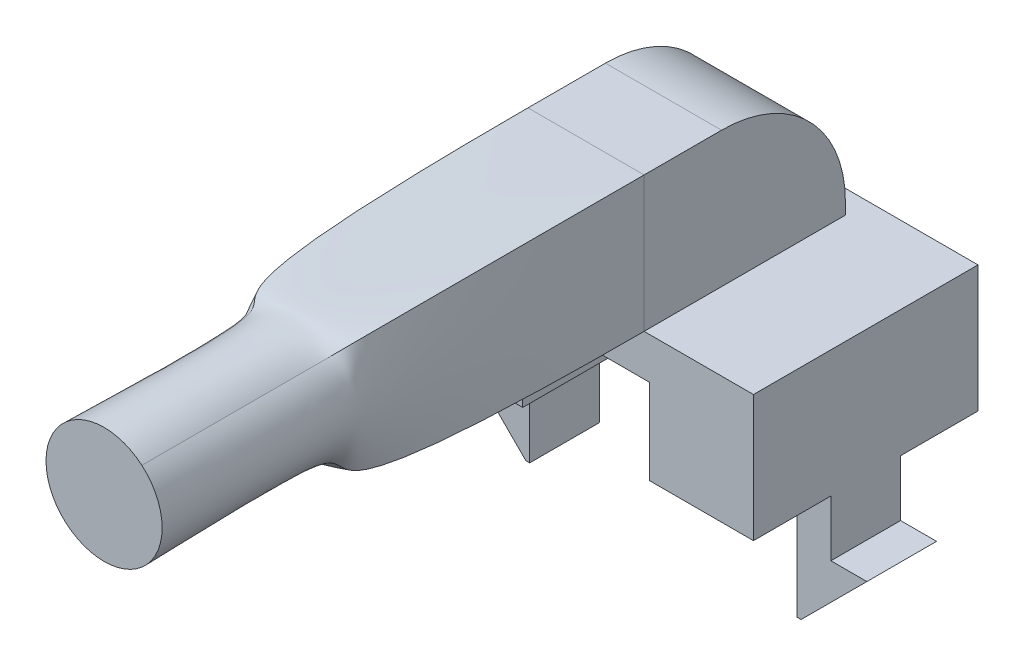
ISO-10303-21;
HEADER;
FILE_DESCRIPTION(('STEP AP214'),'2;1');
FILE_NAME('part.step','',(''),(''),'','','');
FILE_SCHEMA(('AUTOMOTIVE_DESIGN { 1 0 10303 214 1 1 1 1 }'));
ENDSEC;
DATA;
#1=APPLICATION_CONTEXT('core data for automotive mechanical design processes');
#2=APPLICATION_PROTOCOL_DEFINITION('international standard','automotive_design',2000,#1);
#3=PRODUCT_CONTEXT('',#1,'mechanical');
#4=PRODUCT('Part','Part','',(#3));
#5=PRODUCT_RELATED_PRODUCT_CATEGORY('part','',(#4));
#6=PRODUCT_DEFINITION_FORMATION('','',#4);
#7=PRODUCT_DEFINITION_CONTEXT('part definition',#1,'design');
#8=PRODUCT_DEFINITION('design','',#6,#7);
#9=PRODUCT_DEFINITION_SHAPE('','',#8);
#10=(LENGTH_UNIT() NAMED_UNIT(*) SI_UNIT(.MILLI.,.METRE.));
#11=(NAMED_UNIT(*) PLANE_ANGLE_UNIT() SI_UNIT($,.RADIAN.));
#12=(NAMED_UNIT(*) SI_UNIT($,.STERADIAN.) SOLID_ANGLE_UNIT());
#13=UNCERTAINTY_MEASURE_WITH_UNIT(LENGTH_MEASURE(1.E-05),#10,'distance_accuracy_value','');
#14=(GEOMETRIC_REPRESENTATION_CONTEXT(3) GLOBAL_UNCERTAINTY_ASSIGNED_CONTEXT((#13)) GLOBAL_UNIT_ASSIGNED_CONTEXT((#10,
#11,#12)) REPRESENTATION_CONTEXT('',''));
#15=CARTESIAN_POINT('',(0.,0.,0.));
#16=DIRECTION('',(0.,0.,1.));
#17=DIRECTION('',(1.,0.,0.));
#18=AXIS2_PLACEMENT_3D('',#15,#16,#17);
#19=CARTESIAN_POINT('',(-4.325,3.27,2.9));
#20=DIRECTION('',(1.,0.,0.));
#21=DIRECTION('',(0.,0.,-1.));
#22=AXIS2_PLACEMENT_3D('',#19,#20,#21);
#23=PLANE('',#22);
#24=DIRECTION('',(0.,0.,-1.));
#25=VECTOR('',#24,1.);
#26=CARTESIAN_POINT('',(-4.325,-1.45,2.9));
#27=LINE('',#26,#25);
#28=CARTESIAN_POINT('',(-4.325,-1.45,0.9));
#29=VERTEX_POINT('',#28);
#30=CARTESIAN_POINT('',(-4.325,-1.45,-0.9));
#31=VERTEX_POINT('',#30);
#32=EDGE_CURVE('E293',#29,#31,#27,.T.);
#33=ORIENTED_EDGE('',*,*,#32,.F.);
#34=DIRECTION('',(0.,1.,0.));
#35=VECTOR('',#34,1.);
#36=CARTESIAN_POINT('',(-4.325,-3.15,0.9));
#37=LINE('',#36,#35);
#38=CARTESIAN_POINT('',(-4.325,0.,0.9));
#39=VERTEX_POINT('',#38);
#40=EDGE_CURVE('E285',#29,#39,#37,.T.);
#41=ORIENTED_EDGE('',*,*,#40,.T.);
#42=DIRECTION('',(0.,0.,1.));
#43=VECTOR('',#42,1.);
#44=CARTESIAN_POINT('',(-4.325,0.,2.9));
#45=LINE('',#44,#43);
#46=CARTESIAN_POINT('',(-4.325,0.,2.9));
#47=VERTEX_POINT('',#46);
#48=EDGE_CURVE('E550',#39,#47,#45,.T.);
#49=ORIENTED_EDGE('',*,*,#48,.T.);
#50=DIRECTION('',(0.,-1.,0.));
#51=VECTOR('',#50,1.);
#52=CARTESIAN_POINT('',(-4.325,3.27,2.9));
#53=LINE('',#52,#51);
#54=CARTESIAN_POINT('',(-4.325,3.27,2.9));
#55=VERTEX_POINT('',#54);
#56=EDGE_CURVE('E592',#55,#47,#53,.T.);
#57=ORIENTED_EDGE('',*,*,#56,.F.);
#58=DIRECTION('',(0.,0.,1.));
#59=VECTOR('',#58,1.);
#60=CARTESIAN_POINT('',(-4.325,3.27,2.9));
#61=LINE('',#60,#59);
#62=CARTESIAN_POINT('',(-4.325,3.27,-2.9));
#63=VERTEX_POINT('',#62);
#64=EDGE_CURVE('E532',#63,#55,#61,.T.);
#65=ORIENTED_EDGE('',*,*,#64,.F.);
#66=DIRECTION('',(0.,-1.,0.));
#67=VECTOR('',#66,1.);
#68=CARTESIAN_POINT('',(-4.325,3.27,-2.9));
#69=LINE('',#68,#67);
#70=CARTESIAN_POINT('',(-4.325,0.,-2.9));
#71=VERTEX_POINT('',#70);
#72=EDGE_CURVE('E569',#63,#71,#69,.T.);
#73=ORIENTED_EDGE('',*,*,#72,.T.);
#74=CARTESIAN_POINT('',(-4.325,0.,-0.9));
#75=VERTEX_POINT('',#74);
#76=EDGE_CURVE('E551',#71,#75,#45,.T.);
#77=ORIENTED_EDGE('',*,*,#76,.T.);
#78=DIRECTION('',(0.,1.,0.));
#79=VECTOR('',#78,1.);
#80=CARTESIAN_POINT('',(-4.325,-3.15,-0.9));
#81=LINE('',#80,#79);
#82=EDGE_CURVE('E326',#31,#75,#81,.T.);
#83=ORIENTED_EDGE('',*,*,#82,.F.);
#84=EDGE_LOOP('',(#33,#41,#49,#57,#65,#73,#77,#83));
#85=FACE_BOUND('',#84,.T.);
#86=ADVANCED_FACE('F88',(#85),#23,.F.);
#87=CARTESIAN_POINT('',(4.325,3.27,2.9));
#88=DIRECTION('',(-1.,0.,0.));
#89=DIRECTION('',(0.,0.,1.));
#90=AXIS2_PLACEMENT_3D('',#87,#88,#89);
#91=PLANE('',#90);
#92=DIRECTION('',(0.,0.,1.));
#93=VECTOR('',#92,1.);
#94=CARTESIAN_POINT('',(4.325,-1.45,2.9));
#95=LINE('',#94,#93);
#96=CARTESIAN_POINT('',(4.325,-1.45,-0.9));
#97=VERTEX_POINT('',#96);
#98=CARTESIAN_POINT('',(4.325,-1.45,0.9));
#99=VERTEX_POINT('',#98);
#100=EDGE_CURVE('E340',#97,#99,#95,.T.);
#101=ORIENTED_EDGE('',*,*,#100,.F.);
#102=DIRECTION('',(0.,1.,0.));
#103=VECTOR('',#102,1.);
#104=CARTESIAN_POINT('',(4.325,-3.15,-0.9));
#105=LINE('',#104,#103);
#106=CARTESIAN_POINT('',(4.325,0.,-0.9));
#107=VERTEX_POINT('',#106);
#108=EDGE_CURVE('E355',#97,#107,#105,.T.);
#109=ORIENTED_EDGE('',*,*,#108,.T.);
#110=DIRECTION('',(0.,0.,-1.));
#111=VECTOR('',#110,1.);
#112=CARTESIAN_POINT('',(4.325,0.,2.9));
#113=LINE('',#112,#111);
#114=CARTESIAN_POINT('',(4.325,0.,-2.9));
#115=VERTEX_POINT('',#114);
#116=EDGE_CURVE('E605',#107,#115,#113,.T.);
#117=ORIENTED_EDGE('',*,*,#116,.T.);
#118=DIRECTION('',(0.,-1.,0.));
#119=VECTOR('',#118,1.);
#120=CARTESIAN_POINT('',(4.325,3.27,-2.9));
#121=LINE('',#120,#119);
#122=CARTESIAN_POINT('',(4.325,3.27,-2.9));
#123=VERTEX_POINT('',#122);
#124=EDGE_CURVE('E565',#123,#115,#121,.T.);
#125=ORIENTED_EDGE('',*,*,#124,.F.);
#126=DIRECTION('',(0.,0.,-1.));
#127=VECTOR('',#126,1.);
#128=CARTESIAN_POINT('',(4.325,3.27,2.9));
#129=LINE('',#128,#127);
#130=CARTESIAN_POINT('',(4.325,3.27,2.9));
#131=VERTEX_POINT('',#130);
#132=EDGE_CURVE('E547',#131,#123,#129,.T.);
#133=ORIENTED_EDGE('',*,*,#132,.F.);
#134=DIRECTION('',(0.,-1.,0.));
#135=VECTOR('',#134,1.);
#136=CARTESIAN_POINT('',(4.325,3.27,2.9));
#137=LINE('',#136,#135);
#138=CARTESIAN_POINT('',(4.325,0.,2.9));
#139=VERTEX_POINT('',#138);
#140=EDGE_CURVE('E568',#131,#139,#137,.T.);
#141=ORIENTED_EDGE('',*,*,#140,.T.);
#142=CARTESIAN_POINT('',(4.325,0.,0.9));
#143=VERTEX_POINT('',#142);
#144=EDGE_CURVE('E606',#139,#143,#113,.T.);
#145=ORIENTED_EDGE('',*,*,#144,.T.);
#146=DIRECTION('',(0.,1.,0.));
#147=VECTOR('',#146,1.);
#148=CARTESIAN_POINT('',(4.325,-3.15,0.9));
#149=LINE('',#148,#147);
#150=EDGE_CURVE('E374',#99,#143,#149,.T.);
#151=ORIENTED_EDGE('',*,*,#150,.F.);
#152=EDGE_LOOP('',(#101,#109,#117,#125,#133,#141,#145,#151));
#153=FACE_BOUND('',#152,.T.);
#154=ADVANCED_FACE('F718',(#153),#91,.F.);
#155=CARTESIAN_POINT('',(-4.325,0.,-2.9));
#156=DIRECTION('',(0.,1.,0.));
#157=DIRECTION('',(0.,0.,1.));
#158=AXIS2_PLACEMENT_3D('',#155,#156,#157);
#159=PLANE('',#158);
#160=DIRECTION('',(-1.,0.,0.));
#161=VECTOR('',#160,1.);
#162=CARTESIAN_POINT('',(4.325,0.,0.9));
#163=LINE('',#162,#161);
#164=CARTESIAN_POINT('',(3.455,0.,0.9));
#165=VERTEX_POINT('',#164);
#166=EDGE_CURVE('E343',#143,#165,#163,.T.);
#167=ORIENTED_EDGE('',*,*,#166,.F.);
#168=ORIENTED_EDGE('',*,*,#144,.F.);
#169=DIRECTION('',(1.,0.,0.));
#170=VECTOR('',#169,1.);
#171=CARTESIAN_POINT('',(4.325,0.,2.9));
#172=LINE('',#171,#170);
#173=CARTESIAN_POINT('',(1.635,0.,2.9));
#174=VERTEX_POINT('',#173);
#175=EDGE_CURVE('E597',#174,#139,#172,.T.);
#176=ORIENTED_EDGE('',*,*,#175,.F.);
#177=DIRECTION('',(0.,0.,1.));
#178=VECTOR('',#177,1.);
#179=CARTESIAN_POINT('',(1.635,0.,-2.901));
#180=LINE('',#179,#178);
#181=CARTESIAN_POINT('',(1.635,0.,-2.9));
#182=VERTEX_POINT('',#181);
#183=EDGE_CURVE('E557',#182,#174,#180,.T.);
#184=ORIENTED_EDGE('',*,*,#183,.F.);
#185=DIRECTION('',(-1.,0.,0.));
#186=VECTOR('',#185,1.);
#187=CARTESIAN_POINT('',(4.325,0.,-2.9));
#188=LINE('',#187,#186);
#189=EDGE_CURVE('E535',#115,#182,#188,.T.);
#190=ORIENTED_EDGE('',*,*,#189,.F.);
#191=ORIENTED_EDGE('',*,*,#116,.F.);
#192=DIRECTION('',(1.,0.,0.));
#193=VECTOR('',#192,1.);
#194=CARTESIAN_POINT('',(4.325,0.,-0.9));
#195=LINE('',#194,#193);
#196=CARTESIAN_POINT('',(3.455,0.,-0.9));
#197=VERTEX_POINT('',#196);
#198=EDGE_CURVE('E348',#197,#107,#195,.T.);
#199=ORIENTED_EDGE('',*,*,#198,.F.);
#200=DIRECTION('',(0.,0.,-1.));
#201=VECTOR('',#200,1.);
#202=CARTESIAN_POINT('',(3.455,0.,0.9));
#203=LINE('',#202,#201);
#204=EDGE_CURVE('E359',#165,#197,#203,.T.);
#205=ORIENTED_EDGE('',*,*,#204,.F.);
#206=EDGE_LOOP('',(#167,#168,#176,#184,#190,#191,#199,#205));
#207=FACE_BOUND('',#206,.T.);
#208=ADVANCED_FACE('F722',(#207),#159,.F.);
#209=DIRECTION('',(0.,0.,-1.));
#210=VECTOR('',#209,1.);
#211=CARTESIAN_POINT('',(-3.455,0.,0.9));
#212=LINE('',#211,#210);
#213=CARTESIAN_POINT('',(-3.455,0.,0.9));
#214=VERTEX_POINT('',#213);
#215=CARTESIAN_POINT('',(-3.455,0.,-0.9));
#216=VERTEX_POINT('',#215);
#217=EDGE_CURVE('E311',#214,#216,#212,.T.);
#218=ORIENTED_EDGE('',*,*,#217,.T.);
#219=DIRECTION('',(-1.,0.,0.));
#220=VECTOR('',#219,1.);
#221=CARTESIAN_POINT('',(-4.325,0.,-0.9));
#222=LINE('',#221,#220);
#223=EDGE_CURVE('E296',#216,#75,#222,.T.);
#224=ORIENTED_EDGE('',*,*,#223,.T.);
#225=ORIENTED_EDGE('',*,*,#76,.F.);
#226=CARTESIAN_POINT('',(-1.635,0.,-2.9));
#227=VERTEX_POINT('',#226);
#228=EDGE_CURVE('E590',#227,#71,#188,.T.);
#229=ORIENTED_EDGE('',*,*,#228,.F.);
#230=DIRECTION('',(0.,0.,1.));
#231=VECTOR('',#230,1.);
#232=CARTESIAN_POINT('',(-1.635,0.,-2.901));
#233=LINE('',#232,#231);
#234=CARTESIAN_POINT('',(-1.635,0.,2.9));
#235=VERTEX_POINT('',#234);
#236=EDGE_CURVE('E609',#227,#235,#233,.T.);
#237=ORIENTED_EDGE('',*,*,#236,.T.);
#238=EDGE_CURVE('E598',#47,#235,#172,.T.);
#239=ORIENTED_EDGE('',*,*,#238,.F.);
#240=ORIENTED_EDGE('',*,*,#48,.F.);
#241=DIRECTION('',(1.,0.,0.));
#242=VECTOR('',#241,1.);
#243=CARTESIAN_POINT('',(-4.325,0.,0.9));
#244=LINE('',#243,#242);
#245=EDGE_CURVE('E301',#39,#214,#244,.T.);
#246=ORIENTED_EDGE('',*,*,#245,.T.);
#247=EDGE_LOOP('',(#218,#224,#225,#229,#237,#239,#240,#246));
#248=FACE_BOUND('',#247,.T.);
#249=ADVANCED_FACE('F727',(#248),#159,.F.);
#250=CARTESIAN_POINT('',(4.325,3.27,2.9));
#251=DIRECTION('',(0.,0.,-1.));
#252=DIRECTION('',(-1.,0.,0.));
#253=AXIS2_PLACEMENT_3D('',#250,#251,#252);
#254=PLANE('',#253);
#255=DIRECTION('',(1.,0.,0.));
#256=VECTOR('',#255,1.);
#257=CARTESIAN_POINT('',(4.325,3.27,2.9));
#258=LINE('',#257,#256);
#259=CARTESIAN_POINT('',(1.5,3.27,2.9));
#260=VERTEX_POINT('',#259);
#261=EDGE_CURVE('E534',#260,#131,#258,.T.);
#262=ORIENTED_EDGE('',*,*,#261,.F.);
#263=DIRECTION('',(1.,0.,0.));
#264=VECTOR('',#263,1.);
#265=CARTESIAN_POINT('',(-1.5,3.27,2.9));
#266=LINE('',#265,#264);
#267=CARTESIAN_POINT('',(-1.5,3.27,2.9));
#268=VERTEX_POINT('',#267);
#269=EDGE_CURVE('E377',#268,#260,#266,.T.);
#270=ORIENTED_EDGE('',*,*,#269,.F.);
#271=EDGE_CURVE('E545',#55,#268,#258,.T.);
#272=ORIENTED_EDGE('',*,*,#271,.F.);
#273=ORIENTED_EDGE('',*,*,#56,.T.);
#274=ORIENTED_EDGE('',*,*,#238,.T.);
#275=DIRECTION('',(0.,-1.,0.));
#276=VECTOR('',#275,1.);
#277=CARTESIAN_POINT('',(-1.635,0.,2.9));
#278=LINE('',#277,#276);
#279=CARTESIAN_POINT('',(-1.635,2.2,2.9));
#280=VERTEX_POINT('',#279);
#281=EDGE_CURVE('E562',#280,#235,#278,.T.);
#282=ORIENTED_EDGE('',*,*,#281,.F.);
#283=DIRECTION('',(-1.,0.,0.));
#284=VECTOR('',#283,1.);
#285=CARTESIAN_POINT('',(-1.635,2.2,2.9));
#286=LINE('',#285,#284);
#287=CARTESIAN_POINT('',(1.635,2.2,2.9));
#288=VERTEX_POINT('',#287);
#289=EDGE_CURVE('E611',#288,#280,#286,.T.);
#290=ORIENTED_EDGE('',*,*,#289,.F.);
#291=DIRECTION('',(0.,1.,0.));
#292=VECTOR('',#291,1.);
#293=CARTESIAN_POINT('',(1.635,0.,2.9));
#294=LINE('',#293,#292);
#295=EDGE_CURVE('E603',#174,#288,#294,.T.);
#296=ORIENTED_EDGE('',*,*,#295,.F.);
#297=ORIENTED_EDGE('',*,*,#175,.T.);
#298=ORIENTED_EDGE('',*,*,#140,.F.);
#299=EDGE_LOOP('',(#262,#270,#272,#273,#274,#282,#290,#296,#297,#298));
#300=FACE_BOUND('',#299,.T.);
#301=ADVANCED_FACE('F667',(#300),#254,.F.);
#302=CARTESIAN_POINT('',(4.325,3.27,-2.9));
#303=DIRECTION('',(0.,0.,1.));
#304=DIRECTION('',(1.,0.,0.));
#305=AXIS2_PLACEMENT_3D('',#302,#303,#304);
#306=PLANE('',#305);
#307=DIRECTION('',(1.,0.,0.));
#308=VECTOR('',#307,1.);
#309=CARTESIAN_POINT('',(-1.635,2.2,-2.9));
#310=LINE('',#309,#308);
#311=CARTESIAN_POINT('',(-1.635,2.2,-2.9));
#312=VERTEX_POINT('',#311);
#313=CARTESIAN_POINT('',(1.635,2.2,-2.9));
#314=VERTEX_POINT('',#313);
#315=EDGE_CURVE('E563',#312,#314,#310,.T.);
#316=ORIENTED_EDGE('',*,*,#315,.F.);
#317=DIRECTION('',(0.,1.,0.));
#318=VECTOR('',#317,1.);
#319=CARTESIAN_POINT('',(-1.635,0.,-2.9));
#320=LINE('',#319,#318);
#321=EDGE_CURVE('E559',#227,#312,#320,.T.);
#322=ORIENTED_EDGE('',*,*,#321,.F.);
#323=ORIENTED_EDGE('',*,*,#228,.T.);
#324=ORIENTED_EDGE('',*,*,#72,.F.);
#325=DIRECTION('',(-1.,0.,0.));
#326=VECTOR('',#325,1.);
#327=CARTESIAN_POINT('',(4.325,3.27,-2.9));
#328=LINE('',#327,#326);
#329=EDGE_CURVE('E575',#123,#63,#328,.T.);
#330=ORIENTED_EDGE('',*,*,#329,.F.);
#331=ORIENTED_EDGE('',*,*,#124,.T.);
#332=ORIENTED_EDGE('',*,*,#189,.T.);
#333=DIRECTION('',(0.,-1.,0.));
#334=VECTOR('',#333,1.);
#335=CARTESIAN_POINT('',(1.635,0.,-2.9));
#336=LINE('',#335,#334);
#337=EDGE_CURVE('E582',#314,#182,#336,.T.);
#338=ORIENTED_EDGE('',*,*,#337,.F.);
#339=EDGE_LOOP('',(#316,#322,#323,#324,#330,#331,#332,#338));
#340=FACE_BOUND('',#339,.T.);
#341=ADVANCED_FACE('F660',(#340),#306,.F.);
#342=CARTESIAN_POINT('',(-4.325,3.27,-2.9));
#343=DIRECTION('',(0.,1.,0.));
#344=DIRECTION('',(0.,0.,1.));
#345=AXIS2_PLACEMENT_3D('',#342,#343,#344);
#346=PLANE('',#345);
#347=DIRECTION('',(0.,0.,1.));
#348=VECTOR('',#347,1.);
#349=CARTESIAN_POINT('',(-1.5,3.27,-2.3));
#350=LINE('',#349,#348);
#351=CARTESIAN_POINT('',(-1.5,3.27,-2.3));
#352=VERTEX_POINT('',#351);
#353=EDGE_CURVE('E508',#352,#268,#350,.T.);
#354=ORIENTED_EDGE('',*,*,#353,.F.);
#355=DIRECTION('',(-1.,0.,0.));
#356=VECTOR('',#355,1.);
#357=CARTESIAN_POINT('',(1.5,3.27,-2.3));
#358=LINE('',#357,#356);
#359=CARTESIAN_POINT('',(1.5,3.27,-2.3));
#360=VERTEX_POINT('',#359);
#361=EDGE_CURVE('E445',#360,#352,#358,.T.);
#362=ORIENTED_EDGE('',*,*,#361,.F.);
#363=DIRECTION('',(0.,0.,1.));
#364=VECTOR('',#363,1.);
#365=CARTESIAN_POINT('',(1.5,3.27,-2.3));
#366=LINE('',#365,#364);
#367=EDGE_CURVE('E615',#360,#260,#366,.T.);
#368=ORIENTED_EDGE('',*,*,#367,.T.);
#369=ORIENTED_EDGE('',*,*,#261,.T.);
#370=ORIENTED_EDGE('',*,*,#132,.T.);
#371=ORIENTED_EDGE('',*,*,#329,.T.);
#372=ORIENTED_EDGE('',*,*,#64,.T.);
#373=ORIENTED_EDGE('',*,*,#271,.T.);
#374=EDGE_LOOP('',(#354,#362,#368,#369,#370,#371,#372,#373));
#375=FACE_BOUND('',#374,.T.);
#376=ADVANCED_FACE('F653',(#375),#346,.T.);
#377=CARTESIAN_POINT('',(-1.635,0.,-2.901));
#378=DIRECTION('',(-1.,0.,0.));
#379=DIRECTION('',(0.,-1.,0.));
#380=AXIS2_PLACEMENT_3D('',#377,#378,#379);
#381=PLANE('',#380);
#382=ORIENTED_EDGE('',*,*,#321,.T.);
#383=DIRECTION('',(0.,0.,1.));
#384=VECTOR('',#383,1.);
#385=CARTESIAN_POINT('',(-1.635,2.2,-2.901));
#386=LINE('',#385,#384);
#387=EDGE_CURVE('E552',#312,#280,#386,.T.);
#388=ORIENTED_EDGE('',*,*,#387,.T.);
#389=ORIENTED_EDGE('',*,*,#281,.T.);
#390=ORIENTED_EDGE('',*,*,#236,.F.);
#391=EDGE_LOOP('',(#382,#388,#389,#390));
#392=FACE_BOUND('',#391,.T.);
#393=ADVANCED_FACE('F736',(#392),#381,.F.);
#394=CARTESIAN_POINT('',(-1.635,2.2,-2.901));
#395=DIRECTION('',(0.,1.,0.));
#396=DIRECTION('',(-1.,0.,0.));
#397=AXIS2_PLACEMENT_3D('',#394,#395,#396);
#398=PLANE('',#397);
#399=ORIENTED_EDGE('',*,*,#315,.T.);
#400=DIRECTION('',(0.,0.,1.));
#401=VECTOR('',#400,1.);
#402=CARTESIAN_POINT('',(1.635,2.2,-2.901));
#403=LINE('',#402,#401);
#404=EDGE_CURVE('E555',#314,#288,#403,.T.);
#405=ORIENTED_EDGE('',*,*,#404,.T.);
#406=ORIENTED_EDGE('',*,*,#289,.T.);
#407=ORIENTED_EDGE('',*,*,#387,.F.);
#408=EDGE_LOOP('',(#399,#405,#406,#407));
#409=FACE_BOUND('',#408,.T.);
#410=ADVANCED_FACE('F739',(#409),#398,.F.);
#411=CARTESIAN_POINT('',(1.635,0.,-2.901));
#412=DIRECTION('',(1.,0.,0.));
#413=DIRECTION('',(0.,1.,0.));
#414=AXIS2_PLACEMENT_3D('',#411,#412,#413);
#415=PLANE('',#414);
#416=ORIENTED_EDGE('',*,*,#337,.T.);
#417=ORIENTED_EDGE('',*,*,#183,.T.);
#418=ORIENTED_EDGE('',*,*,#295,.T.);
#419=ORIENTED_EDGE('',*,*,#404,.F.);
#420=EDGE_LOOP('',(#416,#417,#418,#419));
#421=FACE_BOUND('',#420,.T.);
#422=ADVANCED_FACE('F741',(#421),#415,.F.);
#423=CARTESIAN_POINT('',(-1.5,3.27,-2.3));
#424=DIRECTION('',(1.,0.,0.));
#425=DIRECTION('',(0.,0.,-1.));
#426=AXIS2_PLACEMENT_3D('',#423,#424,#425);
#427=PLANE('',#426);
#428=DIRECTION('',(0.,0.,1.));
#429=VECTOR('',#428,1.);
#430=CARTESIAN_POINT('',(-1.5,6.77,-2.3));
#431=LINE('',#430,#429);
#432=CARTESIAN_POINT('',(-1.5,6.77,0.899999999999998));
#433=VERTEX_POINT('',#432);
#434=CARTESIAN_POINT('',(-1.5,6.77,2.9));
#435=VERTEX_POINT('',#434);
#436=EDGE_CURVE('E504',#433,#435,#431,.T.);
#437=ORIENTED_EDGE('',*,*,#436,.F.);
#438=CARTESIAN_POINT('',(-1.5,3.57,0.899999999999998));
#439=DIRECTION('',(1.,0.,0.));
#440=DIRECTION('',(0.,0.,-1.));
#441=AXIS2_PLACEMENT_3D('',#438,#439,#440);
#442=CIRCLE('',#441,3.2);
#443=CARTESIAN_POINT('',(-1.5,3.57,-2.3));
#444=VERTEX_POINT('',#443);
#445=EDGE_CURVE('E515',#433,#444,#442,.F.);
#446=ORIENTED_EDGE('',*,*,#445,.T.);
#447=DIRECTION('',(0.,1.,0.));
#448=VECTOR('',#447,1.);
#449=CARTESIAN_POINT('',(-1.5,3.27,-2.3));
#450=LINE('',#449,#448);
#451=EDGE_CURVE('E531',#352,#444,#450,.T.);
#452=ORIENTED_EDGE('',*,*,#451,.F.);
#453=ORIENTED_EDGE('',*,*,#353,.T.);
#454=CARTESIAN_POINT('',(-1.5,6.77,2.9));
#455=CARTESIAN_POINT('',(-1.5,6.18666666666667,2.9));
#456=CARTESIAN_POINT('',(-1.5,5.60333333333333,2.9));
#457=CARTESIAN_POINT('',(-1.5,4.43666666666667,2.9));
#458=CARTESIAN_POINT('',(-1.5,3.85333333333333,2.9));
#459=CARTESIAN_POINT('',(-1.5,3.27,2.9));
#460=B_SPLINE_CURVE_WITH_KNOTS('',3,(#454,#455,#456,#457,#458,#459),.UNSPECIFIED.,.F.,.F.,(4,2,
4),(0.,0.5,1.),.UNSPECIFIED.);
#461=EDGE_CURVE('E544',#268,#435,#460,.F.);
#462=ORIENTED_EDGE('',*,*,#461,.T.);
#463=EDGE_LOOP('',(#437,#446,#452,#453,#462));
#464=FACE_BOUND('',#463,.T.);
#465=ADVANCED_FACE('F485',(#464),#427,.F.);
#466=CARTESIAN_POINT('',(-1.5,6.77,-2.3));
#467=DIRECTION('',(0.,-1.,0.));
#468=DIRECTION('',(0.,0.,-1.));
#469=AXIS2_PLACEMENT_3D('',#466,#467,#468);
#470=PLANE('',#469);
#471=DIRECTION('',(0.,0.,1.));
#472=VECTOR('',#471,1.);
#473=CARTESIAN_POINT('',(1.5,6.77,-2.3));
#474=LINE('',#473,#472);
#475=CARTESIAN_POINT('',(1.5,6.77,0.899999999999998));
#476=VERTEX_POINT('',#475);
#477=CARTESIAN_POINT('',(1.5,6.77,2.9));
#478=VERTEX_POINT('',#477);
#479=EDGE_CURVE('E509',#476,#478,#474,.T.);
#480=ORIENTED_EDGE('',*,*,#479,.F.);
#481=DIRECTION('',(1.,0.,0.));
#482=VECTOR('',#481,1.);
#483=CARTESIAN_POINT('',(-1.5,6.77,0.899999999999998));
#484=LINE('',#483,#482);
#485=EDGE_CURVE('E512',#476,#433,#484,.F.);
#486=ORIENTED_EDGE('',*,*,#485,.T.);
#487=ORIENTED_EDGE('',*,*,#436,.T.);
#488=CARTESIAN_POINT('',(1.5,6.77,2.9));
#489=CARTESIAN_POINT('',(0.5,6.77,2.9));
#490=CARTESIAN_POINT('',(-0.5,6.77,2.9));
#491=CARTESIAN_POINT('',(-1.5,6.77,2.9));
#492=B_SPLINE_CURVE_WITH_KNOTS('',3,(#488,#489,#490,#491),.UNSPECIFIED.,.F.,.F.,(4,4),(0.,1.),.UNSPECIFIED.);
#493=EDGE_CURVE('E580',#435,#478,#492,.F.);
#494=ORIENTED_EDGE('',*,*,#493,.T.);
#495=EDGE_LOOP('',(#480,#486,#487,#494));
#496=FACE_BOUND('',#495,.T.);
#497=ADVANCED_FACE('F480',(#496),#470,.F.);
#498=CARTESIAN_POINT('',(1.5,6.77,-2.3));
#499=DIRECTION('',(-1.,0.,0.));
#500=DIRECTION('',(0.,-1.,0.));
#501=AXIS2_PLACEMENT_3D('',#498,#499,#500);
#502=PLANE('',#501);
#503=DIRECTION('',(0.,-1.,0.));
#504=VECTOR('',#503,1.);
#505=CARTESIAN_POINT('',(1.5,6.77,-2.3));
#506=LINE('',#505,#504);
#507=CARTESIAN_POINT('',(1.5,3.57,-2.3));
#508=VERTEX_POINT('',#507);
#509=EDGE_CURVE('E617',#508,#360,#506,.T.);
#510=ORIENTED_EDGE('',*,*,#509,.F.);
#511=CARTESIAN_POINT('',(1.5,3.57,0.899999999999998));
#512=DIRECTION('',(-1.,0.,0.));
#513=DIRECTION('',(0.,-1.,0.));
#514=AXIS2_PLACEMENT_3D('',#511,#512,#513);
#515=CIRCLE('',#514,3.2);
#516=EDGE_CURVE('E510',#508,#476,#515,.F.);
#517=ORIENTED_EDGE('',*,*,#516,.T.);
#518=ORIENTED_EDGE('',*,*,#479,.T.);
#519=CARTESIAN_POINT('',(1.5,3.27,2.9));
#520=CARTESIAN_POINT('',(1.5,3.85333333333333,2.9));
#521=CARTESIAN_POINT('',(1.5,4.43666666666667,2.9));
#522=CARTESIAN_POINT('',(1.5,5.60333333333333,2.9));
#523=CARTESIAN_POINT('',(1.5,6.18666666666667,2.9));
#524=CARTESIAN_POINT('',(1.5,6.77,2.9));
#525=B_SPLINE_CURVE_WITH_KNOTS('',3,(#519,#520,#521,#522,#523,#524),.UNSPECIFIED.,.F.,.F.,(4,2,
4),(0.,0.5,1.),.UNSPECIFIED.);
#526=EDGE_CURVE('E462',#478,#260,#525,.F.);
#527=ORIENTED_EDGE('',*,*,#526,.T.);
#528=ORIENTED_EDGE('',*,*,#367,.F.);
#529=EDGE_LOOP('',(#510,#517,#518,#527,#528));
#530=FACE_BOUND('',#529,.T.);
#531=ADVANCED_FACE('F470',(#530),#502,.F.);
#532=CARTESIAN_POINT('',(-1.5,3.27,-2.3));
#533=DIRECTION('',(0.,0.,-1.));
#534=DIRECTION('',(-1.,0.,0.));
#535=AXIS2_PLACEMENT_3D('',#532,#533,#534);
#536=PLANE('',#535);
#537=ORIENTED_EDGE('',*,*,#451,.T.);
#538=DIRECTION('',(1.,0.,0.));
#539=VECTOR('',#538,1.);
#540=CARTESIAN_POINT('',(1.5,3.57,-2.3));
#541=LINE('',#540,#539);
#542=EDGE_CURVE('E594',#444,#508,#541,.T.);
#543=ORIENTED_EDGE('',*,*,#542,.T.);
#544=ORIENTED_EDGE('',*,*,#509,.T.);
#545=ORIENTED_EDGE('',*,*,#361,.T.);
#546=EDGE_LOOP('',(#537,#543,#544,#545));
#547=FACE_BOUND('',#546,.T.);
#548=ADVANCED_FACE('F421',(#547),#536,.T.);
#549=CARTESIAN_POINT('',(0.,5.09718746811886,15.35));
#550=DIRECTION('',(0.,0.,1.));
#551=DIRECTION('',(1.,0.,0.));
#552=AXIS2_PLACEMENT_3D('',#549,#550,#551);
#553=PLANE('',#552);
#554=CARTESIAN_POINT('',(0.,5.09718746811886,15.35));
#555=DIRECTION('',(0.,0.,1.));
#556=DIRECTION('',(1.,0.,0.));
#557=AXIS2_PLACEMENT_3D('',#554,#555,#556);
#558=CIRCLE('',#557,1.5);
#559=CARTESIAN_POINT('',(-0.976187060183953,6.2360723716668,15.35));
#560=VERTEX_POINT('',#559);
#561=CARTESIAN_POINT('',(-0.976187060183953,3.95830256457091,15.35));
#562=VERTEX_POINT('',#561);
#563=EDGE_CURVE('E391',#560,#562,#558,.T.);
#564=ORIENTED_EDGE('',*,*,#563,.T.);
#565=CARTESIAN_POINT('',(0.976187060183953,3.95830256457091,15.35));
#566=VERTEX_POINT('',#565);
#567=EDGE_CURVE('E395',#562,#566,#558,.T.);
#568=ORIENTED_EDGE('',*,*,#567,.T.);
#569=CARTESIAN_POINT('',(0.976187060183953,6.2360723716668,15.35));
#570=VERTEX_POINT('',#569);
#571=EDGE_CURVE('E399',#566,#570,#558,.T.);
#572=ORIENTED_EDGE('',*,*,#571,.T.);
#573=EDGE_CURVE('E385',#570,#560,#558,.T.);
#574=ORIENTED_EDGE('',*,*,#573,.T.);
#575=EDGE_LOOP('',(#564,#568,#572,#574));
#576=FACE_BOUND('',#575,.T.);
#577=ADVANCED_FACE('F410',(#576),#553,.T.);
#578=CARTESIAN_POINT('',(-0.976187060183953,6.2360723716668,15.35));
#579=CARTESIAN_POINT('',(-0.943567150669018,6.20282258037706,13.4198906971302));
#580=CARTESIAN_POINT('',(-0.854154100952705,6.1116829884574,8.12934999295088));
#581=CARTESIAN_POINT('',(-1.5,6.77,12.1578847426615));
#582=CARTESIAN_POINT('',(-1.5,6.77,2.9));
#583=CARTESIAN_POINT('',(-0.414705083235289,6.7173426376228,15.35));
#584=CARTESIAN_POINT('',(-0.409393430438155,6.71406345479726,13.4198906971302));
#585=CARTESIAN_POINT('',(-0.394833884360674,6.70507502590924,8.12934999295088));
#586=CARTESIAN_POINT('',(-0.5,6.77,12.1578847426615));
#587=CARTESIAN_POINT('',(-0.5,6.77,2.9));
#588=CARTESIAN_POINT('',(0.414705083235289,6.7173426376228,15.35));
#589=CARTESIAN_POINT('',(0.409393430438155,6.71406345479726,13.4198906971302));
#590=CARTESIAN_POINT('',(0.394833884360677,6.70507502590924,8.12934999295088));
#591=CARTESIAN_POINT('',(0.5,6.77,12.1578847426615));
#592=CARTESIAN_POINT('',(0.5,6.77,2.9));
#593=CARTESIAN_POINT('',(0.976187060183953,6.2360723716668,15.35));
#594=CARTESIAN_POINT('',(0.943567150669019,6.20282258037706,13.4198906971302));
#595=CARTESIAN_POINT('',(0.854154100952709,6.1116829884574,8.12934999295088));
#596=CARTESIAN_POINT('',(1.5,6.77,12.1578847426615));
#597=CARTESIAN_POINT('',(1.5,6.77,2.9));
#598=B_SPLINE_SURFACE_WITH_KNOTS('',3,3,((#578,#579,#580,#581,#582),(#583,#584,#585,#586,#587),
(#588,#589,#590,#591,#592),(#593,#594,#595,#596,#597)),.UNSPECIFIED.,.F.,.F.,.F.,(4,4),(4,1,4),
(0.,1.),(0.,0.364822692195721,1.),.UNSPECIFIED.);
#599=CARTESIAN_POINT('',(0.976187060183953,6.2360723716668,15.35));
#600=CARTESIAN_POINT('',(0.943567150669019,6.20282258037706,13.4198906971302));
#601=CARTESIAN_POINT('',(0.854154100952709,6.1116829884574,8.12934999295088));
#602=CARTESIAN_POINT('',(1.5,6.77,12.1578847426615));
#603=CARTESIAN_POINT('',(1.5,6.77,2.9));
#604=B_SPLINE_CURVE_WITH_KNOTS('',3,(#599,#600,#601,#602,#603),.UNSPECIFIED.,.F.,.F.,(4,1,4),
(0.,0.364822692195721,1.),.UNSPECIFIED.);
#605=EDGE_CURVE('E538',#570,#478,#604,.T.);
#606=CARTESIAN_POINT('',(-0.976187060183953,6.2360723716668,15.35));
#607=CARTESIAN_POINT('',(-0.943567150669018,6.20282258037706,13.4198906971302));
#608=CARTESIAN_POINT('',(-0.854154100952705,6.1116829884574,8.12934999295088));
#609=CARTESIAN_POINT('',(-1.5,6.77,12.1578847426615));
#610=CARTESIAN_POINT('',(-1.5,6.77,2.9));
#611=B_SPLINE_CURVE_WITH_KNOTS('',3,(#606,#607,#608,#609,#610),.UNSPECIFIED.,.F.,.F.,(4,1,4),
(0.,0.364822692195721,1.),.UNSPECIFIED.);
#612=EDGE_CURVE('E541',#435,#560,#611,.F.);
#613=ORIENTED_EDGE('',*,*,#573,.F.);
#614=ORIENTED_EDGE('',*,*,#605,.T.);
#615=ORIENTED_EDGE('',*,*,#493,.F.);
#616=ORIENTED_EDGE('',*,*,#612,.T.);
#617=EDGE_LOOP('',(#613,#614,#615,#616));
#618=FACE_BOUND('',#617,.T.);
#619=ADVANCED_FACE('F420',(#618),#598,.T.);
#620=CARTESIAN_POINT('',(0.976187060183953,6.2360723716668,15.35));
#621=CARTESIAN_POINT('',(0.943567150669019,6.20282258037706,13.4198906971302));
#622=CARTESIAN_POINT('',(0.854154100952709,6.1116829884574,8.12934999295088));
#623=CARTESIAN_POINT('',(1.5,6.77,12.1578847426615));
#624=CARTESIAN_POINT('',(1.5,6.77,2.9));
#625=CARTESIAN_POINT('',(1.30863563716487,5.9511164485403,15.35));
#626=CARTESIAN_POINT('',(1.29671861922665,5.93644780212579,13.4212323312581));
#627=CARTESIAN_POINT('',(1.26405338706549,5.89624019791613,8.13436912345323));
#628=CARTESIAN_POINT('',(1.5,6.18666666666667,12.1363406817757));
#629=CARTESIAN_POINT('',(1.5,6.18666666666667,2.9));
#630=CARTESIAN_POINT('',(1.5,5.53504810172448,15.35));
#631=CARTESIAN_POINT('',(1.5,5.5307957094925,13.422573965386));
#632=CARTESIAN_POINT('',(1.5,5.51913965759947,8.13938825395559));
#633=CARTESIAN_POINT('',(1.5,5.60333333333333,12.1147966208898));
#634=CARTESIAN_POINT('',(1.5,5.60333333333333,2.9));
#635=CARTESIAN_POINT('',(1.5,4.65932683451323,15.35));
#636=CARTESIAN_POINT('',(1.5,4.67319276636724,13.4222862640208));
#637=CARTESIAN_POINT('',(1.5,4.71120008375901,8.13831194658725));
#638=CARTESIAN_POINT('',(1.5,4.43666666666667,12.1194165508686));
#639=CARTESIAN_POINT('',(1.5,4.43666666666667,2.9));
#640=CARTESIAN_POINT('',(1.30863563716487,4.24325848769742,15.35));
#641=CARTESIAN_POINT('',(1.29671861922665,4.26754067373394,13.4206569285278));
#642=CARTESIAN_POINT('',(1.26405338706549,4.33409954344235,8.13221650871656));
#643=CARTESIAN_POINT('',(1.5,3.85333333333333,12.1455805417333));
#644=CARTESIAN_POINT('',(1.5,3.85333333333333,2.9));
#645=CARTESIAN_POINT('',(0.976187060183953,3.95830256457091,15.35));
#646=CARTESIAN_POINT('',(0.943567150669019,4.00116589548268,13.4190275930348));
#647=CARTESIAN_POINT('',(0.854154100952709,4.11865675290109,8.12612107084586));
#648=CARTESIAN_POINT('',(1.5,3.27,12.171744532598));
#649=CARTESIAN_POINT('',(1.5,3.27,2.9));
#650=B_SPLINE_SURFACE_WITH_KNOTS('',3,3,((#620,#621,#622,#623,#624),(#625,#626,#627,#628,#629),
(#630,#631,#632,#633,#634),(#635,#636,#637,#638,#639),(#640,#641,#642,#643,#644),(#645,#646,
#647,#648,#649)),.UNSPECIFIED.,.F.,.F.,.F.,(4,2,4),(4,1,4),(0.,0.5,1.),(0.,0.364822692195721,
1.),.UNSPECIFIED.);
#651=CARTESIAN_POINT('',(0.976187060183953,3.95830256457091,15.35));
#652=CARTESIAN_POINT('',(0.943567150669019,4.00116589548268,13.4190275930348));
#653=CARTESIAN_POINT('',(0.854154100952709,4.11865675290109,8.12612107084586));
#654=CARTESIAN_POINT('',(1.5,3.27,12.171744532598));
#655=CARTESIAN_POINT('',(1.5,3.27,2.9));
#656=B_SPLINE_CURVE_WITH_KNOTS('',3,(#651,#652,#653,#654,#655),.UNSPECIFIED.,.F.,.F.,(4,1,4),
(0.,0.364822692195721,1.),.UNSPECIFIED.);
#657=EDGE_CURVE('E571',#566,#260,#656,.T.);
#658=ORIENTED_EDGE('',*,*,#571,.F.);
#659=ORIENTED_EDGE('',*,*,#657,.T.);
#660=ORIENTED_EDGE('',*,*,#526,.F.);
#661=ORIENTED_EDGE('',*,*,#605,.F.);
#662=EDGE_LOOP('',(#658,#659,#660,#661));
#663=FACE_BOUND('',#662,.T.);
#664=ADVANCED_FACE('F695',(#663),#650,.T.);
#665=CARTESIAN_POINT('',(-0.976187060183953,3.95830256457091,15.35));
#666=CARTESIAN_POINT('',(-0.943567150669018,4.00116589548268,13.4190275930348));
#667=CARTESIAN_POINT('',(-0.854154100952705,4.11865675290109,8.12612107084586));
#668=CARTESIAN_POINT('',(-1.5,3.27,12.171744532598));
#669=CARTESIAN_POINT('',(-1.5,3.27,2.9));
#670=CARTESIAN_POINT('',(-1.30863563716487,4.24325848769742,15.35));
#671=CARTESIAN_POINT('',(-1.29671861922664,4.26754067373395,13.4206569285278));
#672=CARTESIAN_POINT('',(-1.26405338706549,4.33409954344236,8.13221650871656));
#673=CARTESIAN_POINT('',(-1.5,3.85333333333333,12.1455805417333));
#674=CARTESIAN_POINT('',(-1.5,3.85333333333333,2.9));
#675=CARTESIAN_POINT('',(-1.5,4.65932683451323,15.35));
#676=CARTESIAN_POINT('',(-1.5,4.67319276636724,13.4222862640208));
#677=CARTESIAN_POINT('',(-1.5,4.71120008375901,8.13831194658725));
#678=CARTESIAN_POINT('',(-1.5,4.43666666666667,12.1194165508686));
#679=CARTESIAN_POINT('',(-1.5,4.43666666666667,2.9));
#680=CARTESIAN_POINT('',(-1.5,5.53504810172448,15.35));
#681=CARTESIAN_POINT('',(-1.5,5.5307957094925,13.422573965386));
#682=CARTESIAN_POINT('',(-1.5,5.51913965759947,8.13938825395559));
#683=CARTESIAN_POINT('',(-1.5,5.60333333333333,12.1147966208898));
#684=CARTESIAN_POINT('',(-1.5,5.60333333333333,2.9));
#685=CARTESIAN_POINT('',(-1.30863563716487,5.9511164485403,15.35));
#686=CARTESIAN_POINT('',(-1.29671861922664,5.93644780212579,13.4212323312581));
#687=CARTESIAN_POINT('',(-1.26405338706549,5.89624019791613,8.13436912345323));
#688=CARTESIAN_POINT('',(-1.5,6.18666666666667,12.1363406817757));
#689=CARTESIAN_POINT('',(-1.5,6.18666666666667,2.9));
#690=CARTESIAN_POINT('',(-0.976187060183953,6.2360723716668,15.35));
#691=CARTESIAN_POINT('',(-0.943567150669018,6.20282258037706,13.4198906971302));
#692=CARTESIAN_POINT('',(-0.854154100952705,6.1116829884574,8.12934999295088));
#693=CARTESIAN_POINT('',(-1.5,6.77,12.1578847426615));
#694=CARTESIAN_POINT('',(-1.5,6.77,2.9));
#695=B_SPLINE_SURFACE_WITH_KNOTS('',3,3,((#665,#666,#667,#668,#669),(#670,#671,#672,#673,#674),
(#675,#676,#677,#678,#679),(#680,#681,#682,#683,#684),(#685,#686,#687,#688,#689),(#690,#691,
#692,#693,#694)),.UNSPECIFIED.,.F.,.F.,.F.,(4,2,4),(4,1,4),(0.,0.5,1.),(0.,0.364822692195721,
1.),.UNSPECIFIED.);
#696=CARTESIAN_POINT('',(-0.976187060183953,3.95830256457091,15.35));
#697=CARTESIAN_POINT('',(-0.943567150669018,4.00116589548268,13.4190275930348));
#698=CARTESIAN_POINT('',(-0.854154100952705,4.11865675290109,8.12612107084586));
#699=CARTESIAN_POINT('',(-1.5,3.27,12.171744532598));
#700=CARTESIAN_POINT('',(-1.5,3.27,2.9));
#701=B_SPLINE_CURVE_WITH_KNOTS('',3,(#696,#697,#698,#699,#700),.UNSPECIFIED.,.F.,.F.,(4,1,4),
(0.,0.364822692195721,1.),.UNSPECIFIED.);
#702=EDGE_CURVE('E452',#562,#268,#701,.T.);
#703=ORIENTED_EDGE('',*,*,#563,.F.);
#704=ORIENTED_EDGE('',*,*,#612,.F.);
#705=ORIENTED_EDGE('',*,*,#461,.F.);
#706=ORIENTED_EDGE('',*,*,#702,.F.);
#707=EDGE_LOOP('',(#703,#704,#705,#706));
#708=FACE_BOUND('',#707,.T.);
#709=ADVANCED_FACE('F713',(#708),#695,.T.);
#710=CARTESIAN_POINT('',(0.976187060183953,3.95830256457091,15.35));
#711=CARTESIAN_POINT('',(0.943567150669019,4.00116589548268,13.4190275930348));
#712=CARTESIAN_POINT('',(0.854154100952709,4.11865675290109,8.12612107084586));
#713=CARTESIAN_POINT('',(1.5,3.27,12.171744532598));
#714=CARTESIAN_POINT('',(1.5,3.27,2.9));
#715=CARTESIAN_POINT('',(0.414705083235289,3.47703229861492,15.35));
#716=CARTESIAN_POINT('',(0.409393430438156,3.48992502106247,13.4190275930348));
#717=CARTESIAN_POINT('',(0.394833884360678,3.52526471544925,8.12612107084586));
#718=CARTESIAN_POINT('',(0.5,3.27,12.171744532598));
#719=CARTESIAN_POINT('',(0.5,3.27,2.9));
#720=CARTESIAN_POINT('',(-0.414705083235289,3.47703229861492,15.35));
#721=CARTESIAN_POINT('',(-0.409393430438154,3.48992502106247,13.4190275930348));
#722=CARTESIAN_POINT('',(-0.394833884360673,3.52526471544925,8.12612107084586));
#723=CARTESIAN_POINT('',(-0.5,3.27,12.171744532598));
#724=CARTESIAN_POINT('',(-0.5,3.27,2.9));
#725=CARTESIAN_POINT('',(-0.976187060183953,3.95830256457091,15.35));
#726=CARTESIAN_POINT('',(-0.943567150669018,4.00116589548268,13.4190275930348));
#727=CARTESIAN_POINT('',(-0.854154100952705,4.11865675290109,8.12612107084586));
#728=CARTESIAN_POINT('',(-1.5,3.27,12.171744532598));
#729=CARTESIAN_POINT('',(-1.5,3.27,2.9));
#730=B_SPLINE_SURFACE_WITH_KNOTS('',3,3,((#710,#711,#712,#713,#714),(#715,#716,#717,#718,#719),
(#720,#721,#722,#723,#724),(#725,#726,#727,#728,#729)),.UNSPECIFIED.,.F.,.F.,.F.,(4,4),(4,1,4),
(0.,1.),(0.,0.364822692195721,1.),.UNSPECIFIED.);
#731=ORIENTED_EDGE('',*,*,#567,.F.);
#732=ORIENTED_EDGE('',*,*,#702,.T.);
#733=ORIENTED_EDGE('',*,*,#269,.T.);
#734=ORIENTED_EDGE('',*,*,#657,.F.);
#735=EDGE_LOOP('',(#731,#732,#733,#734));
#736=FACE_BOUND('',#735,.T.);
#737=ADVANCED_FACE('F422',(#736),#730,.T.);
#738=CARTESIAN_POINT('',(-1.5,3.57,0.899999999999998));
#739=DIRECTION('',(-1.,0.,0.));
#740=DIRECTION('',(0.,0.,1.));
#741=AXIS2_PLACEMENT_3D('',#738,#739,#740);
#742=CYLINDRICAL_SURFACE('',#741,3.2);
#743=ORIENTED_EDGE('',*,*,#445,.F.);
#744=ORIENTED_EDGE('',*,*,#485,.F.);
#745=ORIENTED_EDGE('',*,*,#516,.F.);
#746=ORIENTED_EDGE('',*,*,#542,.F.);
#747=EDGE_LOOP('',(#743,#744,#745,#746));
#748=FACE_BOUND('',#747,.T.);
#749=ADVANCED_FACE('F704',(#748),#742,.T.);
#750=CARTESIAN_POINT('',(4.325,-3.15,0.9));
#751=DIRECTION('',(0.,0.,-1.));
#752=DIRECTION('',(-1.,0.,0.));
#753=AXIS2_PLACEMENT_3D('',#750,#751,#752);
#754=PLANE('',#753);
#755=DIRECTION('',(-1.,0.,0.));
#756=VECTOR('',#755,1.);
#757=CARTESIAN_POINT('',(4.325,-3.15,0.9));
#758=LINE('',#757,#756);
#759=CARTESIAN_POINT('',(3.555,-3.15,0.9));
#760=VERTEX_POINT('',#759);
#761=CARTESIAN_POINT('',(3.455,-3.15,0.9));
#762=VERTEX_POINT('',#761);
#763=EDGE_CURVE('E344',#760,#762,#758,.T.);
#764=ORIENTED_EDGE('',*,*,#763,.F.);
#765=DIRECTION('',(0.707106781186546,0.707106781186549,0.));
#766=VECTOR('',#765,1.);
#767=CARTESIAN_POINT('',(3.555,-3.15,0.9));
#768=LINE('',#767,#766);
#769=CARTESIAN_POINT('',(5.255,-1.45,0.9));
#770=VERTEX_POINT('',#769);
#771=EDGE_CURVE('E522',#760,#770,#768,.T.);
#772=ORIENTED_EDGE('',*,*,#771,.T.);
#773=DIRECTION('',(-1.,0.,0.));
#774=VECTOR('',#773,1.);
#775=CARTESIAN_POINT('',(3.455,-1.45,0.9));
#776=LINE('',#775,#774);
#777=EDGE_CURVE('E336',#770,#99,#776,.T.);
#778=ORIENTED_EDGE('',*,*,#777,.T.);
#779=ORIENTED_EDGE('',*,*,#150,.T.);
#780=ORIENTED_EDGE('',*,*,#166,.T.);
#781=DIRECTION('',(0.,1.,0.));
#782=VECTOR('',#781,1.);
#783=CARTESIAN_POINT('',(3.455,-3.15,0.9));
#784=LINE('',#783,#782);
#785=EDGE_CURVE('E371',#762,#165,#784,.T.);
#786=ORIENTED_EDGE('',*,*,#785,.F.);
#787=EDGE_LOOP('',(#764,#772,#778,#779,#780,#786));
#788=FACE_BOUND('',#787,.T.);
#789=ADVANCED_FACE('F423',(#788),#754,.F.);
#790=CARTESIAN_POINT('',(3.455,-3.15,0.9));
#791=DIRECTION('',(1.,0.,0.));
#792=DIRECTION('',(0.,0.,-1.));
#793=AXIS2_PLACEMENT_3D('',#790,#791,#792);
#794=PLANE('',#793);
#795=ORIENTED_EDGE('',*,*,#785,.T.);
#796=ORIENTED_EDGE('',*,*,#204,.T.);
#797=DIRECTION('',(0.,1.,0.));
#798=VECTOR('',#797,1.);
#799=CARTESIAN_POINT('',(3.455,-3.15,-0.9));
#800=LINE('',#799,#798);
#801=CARTESIAN_POINT('',(3.455,-3.15,-0.9));
#802=VERTEX_POINT('',#801);
#803=EDGE_CURVE('E368',#802,#197,#800,.T.);
#804=ORIENTED_EDGE('',*,*,#803,.F.);
#805=DIRECTION('',(0.,0.,-1.));
#806=VECTOR('',#805,1.);
#807=CARTESIAN_POINT('',(3.455,-3.15,0.9));
#808=LINE('',#807,#806);
#809=EDGE_CURVE('E347',#762,#802,#808,.T.);
#810=ORIENTED_EDGE('',*,*,#809,.F.);
#811=EDGE_LOOP('',(#795,#796,#804,#810));
#812=FACE_BOUND('',#811,.T.);
#813=ADVANCED_FACE('F711',(#812),#794,.F.);
#814=CARTESIAN_POINT('',(4.325,-3.15,-0.9));
#815=DIRECTION('',(0.,0.,1.));
#816=DIRECTION('',(1.,0.,0.));
#817=AXIS2_PLACEMENT_3D('',#814,#815,#816);
#818=PLANE('',#817);
#819=DIRECTION('',(1.,0.,0.));
#820=VECTOR('',#819,1.);
#821=CARTESIAN_POINT('',(3.455,-1.45,-0.9));
#822=LINE('',#821,#820);
#823=CARTESIAN_POINT('',(5.255,-1.45,-0.9));
#824=VERTEX_POINT('',#823);
#825=EDGE_CURVE('E329',#97,#824,#822,.T.);
#826=ORIENTED_EDGE('',*,*,#825,.T.);
#827=DIRECTION('',(-0.707106781186546,-0.707106781186549,0.));
#828=VECTOR('',#827,1.);
#829=CARTESIAN_POINT('',(3.555,-3.15,-0.9));
#830=LINE('',#829,#828);
#831=CARTESIAN_POINT('',(3.555,-3.15,-0.9));
#832=VERTEX_POINT('',#831);
#833=EDGE_CURVE('E270',#824,#832,#830,.T.);
#834=ORIENTED_EDGE('',*,*,#833,.T.);
#835=DIRECTION('',(1.,0.,0.));
#836=VECTOR('',#835,1.);
#837=CARTESIAN_POINT('',(4.325,-3.15,-0.9));
#838=LINE('',#837,#836);
#839=EDGE_CURVE('E351',#802,#832,#838,.T.);
#840=ORIENTED_EDGE('',*,*,#839,.F.);
#841=ORIENTED_EDGE('',*,*,#803,.T.);
#842=ORIENTED_EDGE('',*,*,#198,.T.);
#843=ORIENTED_EDGE('',*,*,#108,.F.);
#844=EDGE_LOOP('',(#826,#834,#840,#841,#842,#843));
#845=FACE_BOUND('',#844,.T.);
#846=ADVANCED_FACE('F765',(#845),#818,.F.);
#847=CARTESIAN_POINT('',(4.325,-3.15,-0.9));
#848=DIRECTION('',(0.,1.,0.));
#849=DIRECTION('',(0.,0.,1.));
#850=AXIS2_PLACEMENT_3D('',#847,#848,#849);
#851=PLANE('',#850);
#852=ORIENTED_EDGE('',*,*,#839,.T.);
#853=DIRECTION('',(0.,0.,1.));
#854=VECTOR('',#853,1.);
#855=CARTESIAN_POINT('',(3.555,-3.15,0.9));
#856=LINE('',#855,#854);
#857=EDGE_CURVE('E518',#832,#760,#856,.T.);
#858=ORIENTED_EDGE('',*,*,#857,.T.);
#859=ORIENTED_EDGE('',*,*,#763,.T.);
#860=ORIENTED_EDGE('',*,*,#809,.T.);
#861=EDGE_LOOP('',(#852,#858,#859,#860));
#862=FACE_BOUND('',#861,.T.);
#863=ADVANCED_FACE('F780',(#862),#851,.F.);
#864=CARTESIAN_POINT('',(3.455,-1.45,-0.9));
#865=DIRECTION('',(0.,-1.,0.));
#866=DIRECTION('',(0.,0.,-1.));
#867=AXIS2_PLACEMENT_3D('',#864,#865,#866);
#868=PLANE('',#867);
#869=ORIENTED_EDGE('',*,*,#825,.F.);
#870=ORIENTED_EDGE('',*,*,#100,.T.);
#871=ORIENTED_EDGE('',*,*,#777,.F.);
#872=DIRECTION('',(0.,0.,1.));
#873=VECTOR('',#872,1.);
#874=CARTESIAN_POINT('',(5.255,-1.45,0.9));
#875=LINE('',#874,#873);
#876=EDGE_CURVE('E332',#824,#770,#875,.T.);
#877=ORIENTED_EDGE('',*,*,#876,.F.);
#878=EDGE_LOOP('',(#869,#870,#871,#877));
#879=FACE_BOUND('',#878,.T.);
#880=ADVANCED_FACE('F774',(#879),#868,.F.);
#881=CARTESIAN_POINT('',(3.555,-3.15,-0.9));
#882=DIRECTION('',(0.707106781186549,-0.707106781186546,0.));
#883=DIRECTION('',(0.707106781186546,0.707106781186549,0.));
#884=AXIS2_PLACEMENT_3D('',#881,#882,#883);
#885=PLANE('',#884);
#886=ORIENTED_EDGE('',*,*,#833,.F.);
#887=ORIENTED_EDGE('',*,*,#876,.T.);
#888=ORIENTED_EDGE('',*,*,#771,.F.);
#889=ORIENTED_EDGE('',*,*,#857,.F.);
#890=EDGE_LOOP('',(#886,#887,#888,#889));
#891=FACE_BOUND('',#890,.T.);
#892=ADVANCED_FACE('F781',(#891),#885,.T.);
#893=CARTESIAN_POINT('',(-4.325,-3.15,-0.9));
#894=DIRECTION('',(0.,0.,-1.));
#895=DIRECTION('',(-1.,0.,0.));
#896=AXIS2_PLACEMENT_3D('',#893,#894,#895);
#897=PLANE('',#896);
#898=DIRECTION('',(-1.,0.,0.));
#899=VECTOR('',#898,1.);
#900=CARTESIAN_POINT('',(-4.325,-3.15,-0.9));
#901=LINE('',#900,#899);
#902=CARTESIAN_POINT('',(-3.455,-3.15,-0.9));
#903=VERTEX_POINT('',#902);
#904=CARTESIAN_POINT('',(-3.555,-3.15,-0.9));
#905=VERTEX_POINT('',#904);
#906=EDGE_CURVE('E297',#903,#905,#901,.T.);
#907=ORIENTED_EDGE('',*,*,#906,.T.);
#908=DIRECTION('',(0.707106781186546,-0.707106781186549,0.));
#909=VECTOR('',#908,1.);
#910=CARTESIAN_POINT('',(-3.94,-2.765,-0.9));
#911=LINE('',#910,#909);
#912=CARTESIAN_POINT('',(-5.255,-1.45,-0.9));
#913=VERTEX_POINT('',#912);
#914=EDGE_CURVE('E12',#905,#913,#911,.F.);
#915=ORIENTED_EDGE('',*,*,#914,.T.);
#916=DIRECTION('',(-1.,0.,0.));
#917=VECTOR('',#916,1.);
#918=CARTESIAN_POINT('',(-3.455,-1.45,-0.9));
#919=LINE('',#918,#917);
#920=EDGE_CURVE('E279',#31,#913,#919,.T.);
#921=ORIENTED_EDGE('',*,*,#920,.F.);
#922=ORIENTED_EDGE('',*,*,#82,.T.);
#923=ORIENTED_EDGE('',*,*,#223,.F.);
#924=DIRECTION('',(0.,1.,0.));
#925=VECTOR('',#924,1.);
#926=CARTESIAN_POINT('',(-3.455,-3.15,-0.9));
#927=LINE('',#926,#925);
#928=EDGE_CURVE('E323',#903,#216,#927,.T.);
#929=ORIENTED_EDGE('',*,*,#928,.F.);
#930=EDGE_LOOP('',(#907,#915,#921,#922,#923,#929));
#931=FACE_BOUND('',#930,.T.);
#932=ADVANCED_FACE('F783',(#931),#897,.T.);
#933=CARTESIAN_POINT('',(-3.455,-3.15,0.9));
#934=DIRECTION('',(1.,0.,0.));
#935=DIRECTION('',(0.,0.,-1.));
#936=AXIS2_PLACEMENT_3D('',#933,#934,#935);
#937=PLANE('',#936);
#938=ORIENTED_EDGE('',*,*,#928,.T.);
#939=ORIENTED_EDGE('',*,*,#217,.F.);
#940=DIRECTION('',(0.,1.,0.));
#941=VECTOR('',#940,1.);
#942=CARTESIAN_POINT('',(-3.455,-3.15,0.9));
#943=LINE('',#942,#941);
#944=CARTESIAN_POINT('',(-3.455,-3.15,0.9));
#945=VERTEX_POINT('',#944);
#946=EDGE_CURVE('E320',#945,#214,#943,.T.);
#947=ORIENTED_EDGE('',*,*,#946,.F.);
#948=DIRECTION('',(0.,0.,-1.));
#949=VECTOR('',#948,1.);
#950=CARTESIAN_POINT('',(-3.455,-3.15,0.9));
#951=LINE('',#950,#949);
#952=EDGE_CURVE('E300',#945,#903,#951,.T.);
#953=ORIENTED_EDGE('',*,*,#952,.T.);
#954=EDGE_LOOP('',(#938,#939,#947,#953));
#955=FACE_BOUND('',#954,.T.);
#956=ADVANCED_FACE('F788',(#955),#937,.T.);
#957=CARTESIAN_POINT('',(-4.325,-3.15,0.9));
#958=DIRECTION('',(0.,0.,1.));
#959=DIRECTION('',(1.,0.,0.));
#960=AXIS2_PLACEMENT_3D('',#957,#958,#959);
#961=PLANE('',#960);
#962=DIRECTION('',(1.,0.,0.));
#963=VECTOR('',#962,1.);
#964=CARTESIAN_POINT('',(-3.455,-1.45,0.9));
#965=LINE('',#964,#963);
#966=CARTESIAN_POINT('',(-5.255,-1.45,0.9));
#967=VERTEX_POINT('',#966);
#968=EDGE_CURVE('E277',#967,#29,#965,.T.);
#969=ORIENTED_EDGE('',*,*,#968,.F.);
#970=DIRECTION('',(-0.707106781186546,0.707106781186549,0.));
#971=VECTOR('',#970,1.);
#972=CARTESIAN_POINT('',(-3.94,-2.765,0.9));
#973=LINE('',#972,#971);
#974=CARTESIAN_POINT('',(-3.555,-3.15,0.9));
#975=VERTEX_POINT('',#974);
#976=EDGE_CURVE('E111',#967,#975,#973,.F.);
#977=ORIENTED_EDGE('',*,*,#976,.T.);
#978=DIRECTION('',(1.,0.,0.));
#979=VECTOR('',#978,1.);
#980=CARTESIAN_POINT('',(-4.325,-3.15,0.9));
#981=LINE('',#980,#979);
#982=EDGE_CURVE('E305',#975,#945,#981,.T.);
#983=ORIENTED_EDGE('',*,*,#982,.T.);
#984=ORIENTED_EDGE('',*,*,#946,.T.);
#985=ORIENTED_EDGE('',*,*,#245,.F.);
#986=ORIENTED_EDGE('',*,*,#40,.F.);
#987=EDGE_LOOP('',(#969,#977,#983,#984,#985,#986));
#988=FACE_BOUND('',#987,.T.);
#989=ADVANCED_FACE('F283',(#988),#961,.T.);
#990=CARTESIAN_POINT('',(-4.325,-3.15,-0.9));
#991=DIRECTION('',(0.,1.,0.));
#992=DIRECTION('',(0.,0.,1.));
#993=AXIS2_PLACEMENT_3D('',#990,#991,#992);
#994=PLANE('',#993);
#995=ORIENTED_EDGE('',*,*,#982,.F.);
#996=DIRECTION('',(0.,0.,-1.));
#997=VECTOR('',#996,1.);
#998=CARTESIAN_POINT('',(-3.555,-3.15,-0.9));
#999=LINE('',#998,#997);
#1000=EDGE_CURVE('E97',#975,#905,#999,.T.);
#1001=ORIENTED_EDGE('',*,*,#1000,.T.);
#1002=ORIENTED_EDGE('',*,*,#906,.F.);
#1003=ORIENTED_EDGE('',*,*,#952,.F.);
#1004=EDGE_LOOP('',(#995,#1001,#1002,#1003));
#1005=FACE_BOUND('',#1004,.T.);
#1006=ADVANCED_FACE('F837',(#1005),#994,.F.);
#1007=CARTESIAN_POINT('',(-3.455,-1.45,-0.9));
#1008=DIRECTION('',(0.,-1.,0.));
#1009=DIRECTION('',(0.,0.,-1.));
#1010=AXIS2_PLACEMENT_3D('',#1007,#1008,#1009);
#1011=PLANE('',#1010);
#1012=ORIENTED_EDGE('',*,*,#968,.T.);
#1013=ORIENTED_EDGE('',*,*,#32,.T.);
#1014=ORIENTED_EDGE('',*,*,#920,.T.);
#1015=DIRECTION('',(0.,0.,1.));
#1016=VECTOR('',#1015,1.);
#1017=CARTESIAN_POINT('',(-5.255,-1.45,0.9));
#1018=LINE('',#1017,#1016);
#1019=EDGE_CURVE('E268',#913,#967,#1018,.T.);
#1020=ORIENTED_EDGE('',*,*,#1019,.T.);
#1021=EDGE_LOOP('',(#1012,#1013,#1014,#1020));
#1022=FACE_BOUND('',#1021,.T.);
#1023=ADVANCED_FACE('F275',(#1022),#1011,.F.);
#1024=CARTESIAN_POINT('',(-5.255,-1.44999999999999,0.9));
#1025=DIRECTION('',(0.707106781186549,0.707106781186546,0.));
#1026=DIRECTION('',(-0.707106781186546,0.707106781186549,0.));
#1027=AXIS2_PLACEMENT_3D('',#1024,#1025,#1026);
#1028=PLANE('',#1027);
#1029=ORIENTED_EDGE('',*,*,#914,.F.);
#1030=ORIENTED_EDGE('',*,*,#1000,.F.);
#1031=ORIENTED_EDGE('',*,*,#976,.F.);
#1032=ORIENTED_EDGE('',*,*,#1019,.F.);
#1033=EDGE_LOOP('',(#1029,#1030,#1031,#1032));
#1034=FACE_BOUND('',#1033,.T.);
#1035=ADVANCED_FACE('F90',(#1034),#1028,.F.);
#1036=CLOSED_SHELL('',(#86,#154,#208,#249,#301,#341,#376,#393,#410,#422,#465,#497,#531,#548,
#577,#619,#664,#709,#737,#749,#789,#813,#846,#863,#880,#892,#932,#956,#989,#1006,#1023,#1035));
#1037=MANIFOLD_SOLID_BREP('B2',#1036);
#1038=ADVANCED_BREP_SHAPE_REPRESENTATION('',(#18,#1037),#14);
#1039=SHAPE_DEFINITION_REPRESENTATION(#9,#1038);
ENDSEC;
END-ISO-10303-21;
